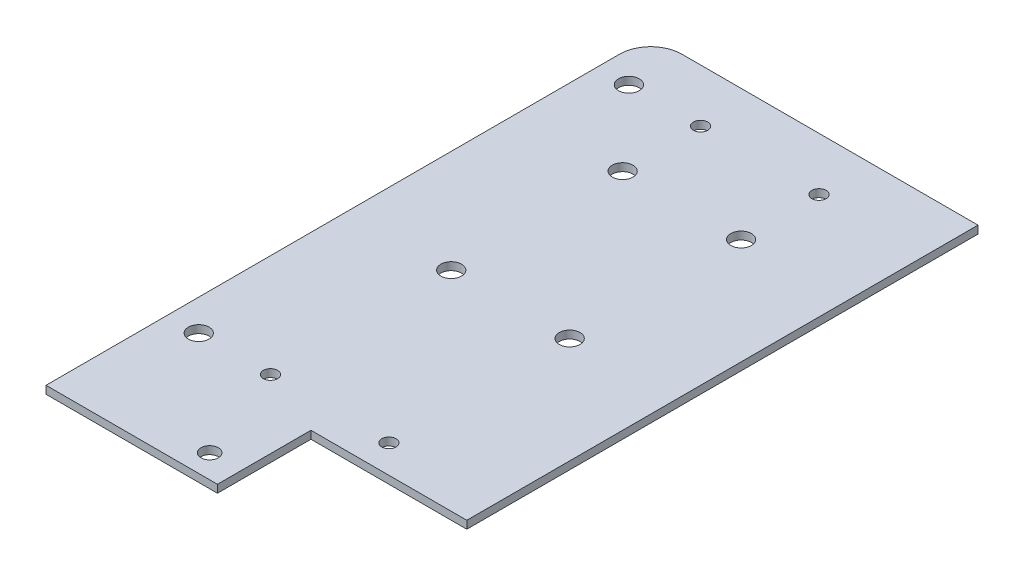
ISO-10303-21;
HEADER;
FILE_DESCRIPTION(('STEP AP214'),'2;1');
FILE_NAME('part.step','',(''),(''),'','','');
FILE_SCHEMA(('AUTOMOTIVE_DESIGN { 1 0 10303 214 1 1 1 1 }'));
ENDSEC;
DATA;
#1=APPLICATION_CONTEXT('core data for automotive mechanical design processes');
#2=APPLICATION_PROTOCOL_DEFINITION('international standard','automotive_design',2000,#1);
#3=PRODUCT_CONTEXT('',#1,'mechanical');
#4=PRODUCT('Part','Part','',(#3));
#5=PRODUCT_RELATED_PRODUCT_CATEGORY('part','',(#4));
#6=PRODUCT_DEFINITION_FORMATION('','',#4);
#7=PRODUCT_DEFINITION_CONTEXT('part definition',#1,'design');
#8=PRODUCT_DEFINITION('design','',#6,#7);
#9=PRODUCT_DEFINITION_SHAPE('','',#8);
#10=(LENGTH_UNIT() NAMED_UNIT(*) SI_UNIT(.MILLI.,.METRE.));
#11=(NAMED_UNIT(*) PLANE_ANGLE_UNIT() SI_UNIT($,.RADIAN.));
#12=(NAMED_UNIT(*) SI_UNIT($,.STERADIAN.) SOLID_ANGLE_UNIT());
#13=UNCERTAINTY_MEASURE_WITH_UNIT(LENGTH_MEASURE(1.E-05),#10,'distance_accuracy_value','');
#14=(GEOMETRIC_REPRESENTATION_CONTEXT(3) GLOBAL_UNCERTAINTY_ASSIGNED_CONTEXT((#13)) GLOBAL_UNIT_ASSIGNED_CONTEXT((#10,
#11,#12)) REPRESENTATION_CONTEXT('',''));
#15=CARTESIAN_POINT('',(0.,0.,0.));
#16=DIRECTION('',(0.,0.,1.));
#17=DIRECTION('',(1.,0.,0.));
#18=AXIS2_PLACEMENT_3D('',#15,#16,#17);
#19=CARTESIAN_POINT('',(0.,1.25,0.));
#20=DIRECTION('',(0.,1.,0.));
#21=DIRECTION('',(0.,0.,1.));
#22=AXIS2_PLACEMENT_3D('',#19,#20,#21);
#23=PLANE('',#22);
#24=CARTESIAN_POINT('',(-9.71346704871064,1.25,3.29011461318052));
#25=DIRECTION('',(0.,1.,0.));
#26=DIRECTION('',(0.,0.,1.));
#27=AXIS2_PLACEMENT_3D('',#24,#25,#26);
#28=CIRCLE('',#27,1.66);
#29=CARTESIAN_POINT('',(-9.71346704871064,1.25,4.95011461318052));
#30=VERTEX_POINT('',#29);
#31=EDGE_CURVE('E217',#30,#30,#28,.T.);
#32=ORIENTED_EDGE('',*,*,#31,.F.);
#33=EDGE_LOOP('',(#32));
#34=FACE_BOUND('',#33,.T.);
#35=CARTESIAN_POINT('',(1.78653295128937,1.25,3.29011461318052));
#36=DIRECTION('',(0.,1.,0.));
#37=DIRECTION('',(0.,0.,1.));
#38=AXIS2_PLACEMENT_3D('',#35,#36,#37);
#39=CIRCLE('',#38,1.15);
#40=CARTESIAN_POINT('',(1.78653295128937,1.25,4.44011461318052));
#41=VERTEX_POINT('',#40);
#42=EDGE_CURVE('E205',#41,#41,#39,.T.);
#43=ORIENTED_EDGE('',*,*,#42,.F.);
#44=EDGE_LOOP('',(#43));
#45=FACE_BOUND('',#44,.T.);
#46=CARTESIAN_POINT('',(20.7865329512894,1.25,-53.2098853868195));
#47=DIRECTION('',(0.,1.,0.));
#48=DIRECTION('',(0.,0.,1.));
#49=AXIS2_PLACEMENT_3D('',#46,#47,#48);
#50=CIRCLE('',#49,1.66);
#51=CARTESIAN_POINT('',(20.7865329512894,1.25,-51.5498853868195));
#52=VERTEX_POINT('',#51);
#53=EDGE_CURVE('E193',#52,#52,#50,.T.);
#54=ORIENTED_EDGE('',*,*,#53,.F.);
#55=EDGE_LOOP('',(#54));
#56=FACE_BOUND('',#55,.T.);
#57=CARTESIAN_POINT('',(1.78653295128937,1.25,-53.2098853868195));
#58=DIRECTION('',(0.,1.,0.));
#59=DIRECTION('',(0.,0.,1.));
#60=AXIS2_PLACEMENT_3D('',#57,#58,#59);
#61=CIRCLE('',#60,1.66);
#62=CARTESIAN_POINT('',(1.78653295128937,1.25,-51.5498853868195));
#63=VERTEX_POINT('',#62);
#64=EDGE_CURVE('E181',#63,#63,#61,.T.);
#65=ORIENTED_EDGE('',*,*,#64,.F.);
#66=EDGE_LOOP('',(#65));
#67=FACE_BOUND('',#66,.T.);
#68=CARTESIAN_POINT('',(1.78653295128937,1.25,-65.7098853868195));
#69=DIRECTION('',(0.,1.,0.));
#70=DIRECTION('',(0.,0.,1.));
#71=AXIS2_PLACEMENT_3D('',#68,#69,#70);
#72=CIRCLE('',#71,1.15);
#73=CARTESIAN_POINT('',(1.78653295128937,1.25,-64.5598853868195));
#74=VERTEX_POINT('',#73);
#75=EDGE_CURVE('E169',#74,#74,#72,.T.);
#76=ORIENTED_EDGE('',*,*,#75,.F.);
#77=EDGE_LOOP('',(#76));
#78=FACE_BOUND('',#77,.T.);
#79=DIRECTION('',(-1.,0.,0.));
#80=VECTOR('',#79,1.);
#81=CARTESIAN_POINT('',(37.7865329512894,1.25,-74.2098853868195));
#82=LINE('',#81,#80);
#83=CARTESIAN_POINT('',(37.7865329512894,1.25,-74.2098853868195));
#84=VERTEX_POINT('',#83);
#85=CARTESIAN_POINT('',(-9.71346704871064,1.25,-74.2098853868195));
#86=VERTEX_POINT('',#85);
#87=EDGE_CURVE('E101',#84,#86,#82,.T.);
#88=ORIENTED_EDGE('',*,*,#87,.T.);
#89=CARTESIAN_POINT('',(-9.71346704871063,1.25,-69.2098853868195));
#90=DIRECTION('',(0.,1.,0.));
#91=DIRECTION('',(0.,0.,1.));
#92=AXIS2_PLACEMENT_3D('',#89,#90,#91);
#93=CIRCLE('',#92,5.);
#94=CARTESIAN_POINT('',(-14.7134670487106,1.25,-69.2098853868195));
#95=VERTEX_POINT('',#94);
#96=EDGE_CURVE('E11',#86,#95,#93,.T.);
#97=ORIENTED_EDGE('',*,*,#96,.T.);
#98=DIRECTION('',(0.,0.,1.));
#99=VECTOR('',#98,1.);
#100=CARTESIAN_POINT('',(-14.7134670487106,1.25,-74.2098853868195));
#101=LINE('',#100,#99);
#102=CARTESIAN_POINT('',(-14.7134670487106,1.25,22.7901146131805));
#103=VERTEX_POINT('',#102);
#104=EDGE_CURVE('E91',#95,#103,#101,.T.);
#105=ORIENTED_EDGE('',*,*,#104,.T.);
#106=DIRECTION('',(1.,0.,0.));
#107=VECTOR('',#106,1.);
#108=CARTESIAN_POINT('',(-14.7134670487106,1.25,22.7901146131805));
#109=LINE('',#108,#107);
#110=CARTESIAN_POINT('',(12.7865329512894,1.25,22.7901146131805));
#111=VERTEX_POINT('',#110);
#112=EDGE_CURVE('E95',#103,#111,#109,.T.);
#113=ORIENTED_EDGE('',*,*,#112,.T.);
#114=DIRECTION('',(0.,0.,-1.));
#115=VECTOR('',#114,1.);
#116=CARTESIAN_POINT('',(12.7865329512894,1.25,22.7901146131805));
#117=LINE('',#116,#115);
#118=CARTESIAN_POINT('',(12.7865329512894,1.25,7.79011461318052));
#119=VERTEX_POINT('',#118);
#120=EDGE_CURVE('E115',#111,#119,#117,.T.);
#121=ORIENTED_EDGE('',*,*,#120,.T.);
#122=DIRECTION('',(1.,0.,0.));
#123=VECTOR('',#122,1.);
#124=CARTESIAN_POINT('',(12.7865329512894,1.25,7.79011461318052));
#125=LINE('',#124,#123);
#126=CARTESIAN_POINT('',(37.7865329512894,1.25,7.79011461318051));
#127=VERTEX_POINT('',#126);
#128=EDGE_CURVE('E117',#119,#127,#125,.T.);
#129=ORIENTED_EDGE('',*,*,#128,.T.);
#130=DIRECTION('',(0.,0.,-1.));
#131=VECTOR('',#130,1.);
#132=CARTESIAN_POINT('',(37.7865329512894,1.25,7.79011461318051));
#133=LINE('',#132,#131);
#134=EDGE_CURVE('E122',#127,#84,#133,.T.);
#135=ORIENTED_EDGE('',*,*,#134,.T.);
#136=EDGE_LOOP('',(#88,#97,#105,#113,#121,#129,#135));
#137=FACE_BOUND('',#136,.T.);
#138=CARTESIAN_POINT('',(-9.71346704871064,1.25,-65.7098853868195));
#139=DIRECTION('',(0.,1.,0.));
#140=DIRECTION('',(0.,0.,1.));
#141=AXIS2_PLACEMENT_3D('',#138,#139,#140);
#142=CIRCLE('',#141,1.66);
#143=CARTESIAN_POINT('',(-9.71346704871064,1.25,-64.0498853868195));
#144=VERTEX_POINT('',#143);
#145=EDGE_CURVE('E127',#144,#144,#142,.T.);
#146=ORIENTED_EDGE('',*,*,#145,.F.);
#147=EDGE_LOOP('',(#146));
#148=FACE_BOUND('',#147,.T.);
#149=CARTESIAN_POINT('',(20.7865329512894,1.25,-65.7098853868195));
#150=DIRECTION('',(0.,1.,0.));
#151=DIRECTION('',(0.,0.,1.));
#152=AXIS2_PLACEMENT_3D('',#149,#150,#151);
#153=CIRCLE('',#152,1.15);
#154=CARTESIAN_POINT('',(20.7865329512894,1.25,-64.5598853868195));
#155=VERTEX_POINT('',#154);
#156=EDGE_CURVE('E175',#155,#155,#153,.T.);
#157=ORIENTED_EDGE('',*,*,#156,.F.);
#158=EDGE_LOOP('',(#157));
#159=FACE_BOUND('',#158,.T.);
#160=CARTESIAN_POINT('',(1.78653295128937,1.25,-25.7098853868195));
#161=DIRECTION('',(0.,1.,0.));
#162=DIRECTION('',(0.,0.,1.));
#163=AXIS2_PLACEMENT_3D('',#160,#161,#162);
#164=CIRCLE('',#163,1.66);
#165=CARTESIAN_POINT('',(1.78653295128937,1.25,-24.0498853868195));
#166=VERTEX_POINT('',#165);
#167=EDGE_CURVE('E187',#166,#166,#164,.T.);
#168=ORIENTED_EDGE('',*,*,#167,.F.);
#169=EDGE_LOOP('',(#168));
#170=FACE_BOUND('',#169,.T.);
#171=CARTESIAN_POINT('',(20.7865329512894,1.25,-25.7098853868195));
#172=DIRECTION('',(0.,1.,0.));
#173=DIRECTION('',(0.,0.,1.));
#174=AXIS2_PLACEMENT_3D('',#171,#172,#173);
#175=CIRCLE('',#174,1.66);
#176=CARTESIAN_POINT('',(20.7865329512894,1.25,-24.0498853868195));
#177=VERTEX_POINT('',#176);
#178=EDGE_CURVE('E199',#177,#177,#175,.T.);
#179=ORIENTED_EDGE('',*,*,#178,.F.);
#180=EDGE_LOOP('',(#179));
#181=FACE_BOUND('',#180,.T.);
#182=CARTESIAN_POINT('',(20.7865329512894,1.25,3.29011461318052));
#183=DIRECTION('',(0.,1.,0.));
#184=DIRECTION('',(0.,0.,1.));
#185=AXIS2_PLACEMENT_3D('',#182,#183,#184);
#186=CIRCLE('',#185,1.15);
#187=CARTESIAN_POINT('',(20.7865329512894,1.25,4.44011461318052));
#188=VERTEX_POINT('',#187);
#189=EDGE_CURVE('E211',#188,#188,#186,.T.);
#190=ORIENTED_EDGE('',*,*,#189,.F.);
#191=EDGE_LOOP('',(#190));
#192=FACE_BOUND('',#191,.T.);
#193=CARTESIAN_POINT('',(7.78653295128937,1.25,19.0401146131805));
#194=DIRECTION('',(0.,1.,0.));
#195=DIRECTION('',(0.,0.,1.));
#196=AXIS2_PLACEMENT_3D('',#193,#194,#195);
#197=CIRCLE('',#196,1.4);
#198=CARTESIAN_POINT('',(7.78653295128937,1.25,20.4401146131805));
#199=VERTEX_POINT('',#198);
#200=EDGE_CURVE('E223',#199,#199,#197,.T.);
#201=ORIENTED_EDGE('',*,*,#200,.F.);
#202=EDGE_LOOP('',(#201));
#203=FACE_BOUND('',#202,.T.);
#204=ADVANCED_FACE('F33',(#34,#45,#56,#67,#78,#137,#148,#159,#170,#181,#192,#203),#23,.T.);
#205=CARTESIAN_POINT('',(0.,0.,0.));
#206=DIRECTION('',(0.,1.,0.));
#207=DIRECTION('',(0.,0.,1.));
#208=AXIS2_PLACEMENT_3D('',#205,#206,#207);
#209=PLANE('',#208);
#210=DIRECTION('',(0.,0.,1.));
#211=VECTOR('',#210,1.);
#212=CARTESIAN_POINT('',(-14.7134670487106,0.,-74.2098853868195));
#213=LINE('',#212,#211);
#214=CARTESIAN_POINT('',(-14.7134670487106,0.,-69.2098853868195));
#215=VERTEX_POINT('',#214);
#216=CARTESIAN_POINT('',(-14.7134670487106,0.,22.7901146131805));
#217=VERTEX_POINT('',#216);
#218=EDGE_CURVE('E106',#215,#217,#213,.T.);
#219=ORIENTED_EDGE('',*,*,#218,.F.);
#220=CARTESIAN_POINT('',(-9.71346704871063,0.,-69.2098853868195));
#221=DIRECTION('',(0.,1.,0.));
#222=DIRECTION('',(0.,0.,1.));
#223=AXIS2_PLACEMENT_3D('',#220,#221,#222);
#224=CIRCLE('',#223,5.);
#225=CARTESIAN_POINT('',(-9.71346704871064,0.,-74.2098853868195));
#226=VERTEX_POINT('',#225);
#227=EDGE_CURVE('E55',#215,#226,#224,.F.);
#228=ORIENTED_EDGE('',*,*,#227,.T.);
#229=DIRECTION('',(-1.,0.,0.));
#230=VECTOR('',#229,1.);
#231=CARTESIAN_POINT('',(37.7865329512894,0.,-74.2098853868195));
#232=LINE('',#231,#230);
#233=CARTESIAN_POINT('',(37.7865329512894,0.,-74.2098853868195));
#234=VERTEX_POINT('',#233);
#235=EDGE_CURVE('E125',#234,#226,#232,.T.);
#236=ORIENTED_EDGE('',*,*,#235,.F.);
#237=DIRECTION('',(0.,0.,-1.));
#238=VECTOR('',#237,1.);
#239=CARTESIAN_POINT('',(37.7865329512894,0.,7.79011461318051));
#240=LINE('',#239,#238);
#241=CARTESIAN_POINT('',(37.7865329512894,0.,7.79011461318051));
#242=VERTEX_POINT('',#241);
#243=EDGE_CURVE('E135',#242,#234,#240,.T.);
#244=ORIENTED_EDGE('',*,*,#243,.F.);
#245=DIRECTION('',(1.,0.,0.));
#246=VECTOR('',#245,1.);
#247=CARTESIAN_POINT('',(12.7865329512894,0.,7.79011461318052));
#248=LINE('',#247,#246);
#249=CARTESIAN_POINT('',(12.7865329512894,0.,7.79011461318052));
#250=VERTEX_POINT('',#249);
#251=EDGE_CURVE('E133',#250,#242,#248,.T.);
#252=ORIENTED_EDGE('',*,*,#251,.F.);
#253=DIRECTION('',(0.,0.,-1.));
#254=VECTOR('',#253,1.);
#255=CARTESIAN_POINT('',(12.7865329512894,0.,22.7901146131805));
#256=LINE('',#255,#254);
#257=CARTESIAN_POINT('',(12.7865329512894,0.,22.7901146131805));
#258=VERTEX_POINT('',#257);
#259=EDGE_CURVE('E131',#258,#250,#256,.T.);
#260=ORIENTED_EDGE('',*,*,#259,.F.);
#261=DIRECTION('',(1.,0.,0.));
#262=VECTOR('',#261,1.);
#263=CARTESIAN_POINT('',(-14.7134670487106,0.,22.7901146131805));
#264=LINE('',#263,#262);
#265=EDGE_CURVE('E129',#217,#258,#264,.T.);
#266=ORIENTED_EDGE('',*,*,#265,.F.);
#267=EDGE_LOOP('',(#219,#228,#236,#244,#252,#260,#266));
#268=FACE_BOUND('',#267,.T.);
#269=CARTESIAN_POINT('',(-9.71346704871064,0.,-65.7098853868195));
#270=DIRECTION('',(0.,1.,0.));
#271=DIRECTION('',(0.,0.,1.));
#272=AXIS2_PLACEMENT_3D('',#269,#270,#271);
#273=CIRCLE('',#272,1.66);
#274=CARTESIAN_POINT('',(-9.71346704871064,0.,-64.0498853868195));
#275=VERTEX_POINT('',#274);
#276=EDGE_CURVE('E166',#275,#275,#273,.T.);
#277=ORIENTED_EDGE('',*,*,#276,.T.);
#278=EDGE_LOOP('',(#277));
#279=FACE_BOUND('',#278,.T.);
#280=CARTESIAN_POINT('',(1.78653295128937,0.,-65.7098853868195));
#281=DIRECTION('',(0.,1.,0.));
#282=DIRECTION('',(0.,0.,1.));
#283=AXIS2_PLACEMENT_3D('',#280,#281,#282);
#284=CIRCLE('',#283,1.15);
#285=CARTESIAN_POINT('',(1.78653295128937,0.,-64.5598853868195));
#286=VERTEX_POINT('',#285);
#287=EDGE_CURVE('E172',#286,#286,#284,.T.);
#288=ORIENTED_EDGE('',*,*,#287,.T.);
#289=EDGE_LOOP('',(#288));
#290=FACE_BOUND('',#289,.T.);
#291=CARTESIAN_POINT('',(20.7865329512894,0.,-65.7098853868195));
#292=DIRECTION('',(0.,1.,0.));
#293=DIRECTION('',(0.,0.,1.));
#294=AXIS2_PLACEMENT_3D('',#291,#292,#293);
#295=CIRCLE('',#294,1.15);
#296=CARTESIAN_POINT('',(20.7865329512894,0.,-64.5598853868195));
#297=VERTEX_POINT('',#296);
#298=EDGE_CURVE('E178',#297,#297,#295,.T.);
#299=ORIENTED_EDGE('',*,*,#298,.T.);
#300=EDGE_LOOP('',(#299));
#301=FACE_BOUND('',#300,.T.);
#302=CARTESIAN_POINT('',(1.78653295128937,0.,-53.2098853868195));
#303=DIRECTION('',(0.,1.,0.));
#304=DIRECTION('',(0.,0.,1.));
#305=AXIS2_PLACEMENT_3D('',#302,#303,#304);
#306=CIRCLE('',#305,1.66);
#307=CARTESIAN_POINT('',(1.78653295128937,0.,-51.5498853868195));
#308=VERTEX_POINT('',#307);
#309=EDGE_CURVE('E184',#308,#308,#306,.T.);
#310=ORIENTED_EDGE('',*,*,#309,.T.);
#311=EDGE_LOOP('',(#310));
#312=FACE_BOUND('',#311,.T.);
#313=CARTESIAN_POINT('',(1.78653295128937,0.,-25.7098853868195));
#314=DIRECTION('',(0.,1.,0.));
#315=DIRECTION('',(0.,0.,1.));
#316=AXIS2_PLACEMENT_3D('',#313,#314,#315);
#317=CIRCLE('',#316,1.66);
#318=CARTESIAN_POINT('',(1.78653295128937,0.,-24.0498853868195));
#319=VERTEX_POINT('',#318);
#320=EDGE_CURVE('E190',#319,#319,#317,.T.);
#321=ORIENTED_EDGE('',*,*,#320,.T.);
#322=EDGE_LOOP('',(#321));
#323=FACE_BOUND('',#322,.T.);
#324=CARTESIAN_POINT('',(20.7865329512894,0.,-53.2098853868195));
#325=DIRECTION('',(0.,1.,0.));
#326=DIRECTION('',(0.,0.,1.));
#327=AXIS2_PLACEMENT_3D('',#324,#325,#326);
#328=CIRCLE('',#327,1.66);
#329=CARTESIAN_POINT('',(20.7865329512894,0.,-51.5498853868195));
#330=VERTEX_POINT('',#329);
#331=EDGE_CURVE('E196',#330,#330,#328,.T.);
#332=ORIENTED_EDGE('',*,*,#331,.T.);
#333=EDGE_LOOP('',(#332));
#334=FACE_BOUND('',#333,.T.);
#335=CARTESIAN_POINT('',(20.7865329512894,0.,-25.7098853868195));
#336=DIRECTION('',(0.,1.,0.));
#337=DIRECTION('',(0.,0.,1.));
#338=AXIS2_PLACEMENT_3D('',#335,#336,#337);
#339=CIRCLE('',#338,1.66);
#340=CARTESIAN_POINT('',(20.7865329512894,0.,-24.0498853868195));
#341=VERTEX_POINT('',#340);
#342=EDGE_CURVE('E202',#341,#341,#339,.T.);
#343=ORIENTED_EDGE('',*,*,#342,.T.);
#344=EDGE_LOOP('',(#343));
#345=FACE_BOUND('',#344,.T.);
#346=CARTESIAN_POINT('',(1.78653295128937,0.,3.29011461318052));
#347=DIRECTION('',(0.,1.,0.));
#348=DIRECTION('',(0.,0.,1.));
#349=AXIS2_PLACEMENT_3D('',#346,#347,#348);
#350=CIRCLE('',#349,1.15);
#351=CARTESIAN_POINT('',(1.78653295128937,0.,4.44011461318052));
#352=VERTEX_POINT('',#351);
#353=EDGE_CURVE('E208',#352,#352,#350,.T.);
#354=ORIENTED_EDGE('',*,*,#353,.T.);
#355=EDGE_LOOP('',(#354));
#356=FACE_BOUND('',#355,.T.);
#357=CARTESIAN_POINT('',(20.7865329512894,0.,3.29011461318052));
#358=DIRECTION('',(0.,1.,0.));
#359=DIRECTION('',(0.,0.,1.));
#360=AXIS2_PLACEMENT_3D('',#357,#358,#359);
#361=CIRCLE('',#360,1.15);
#362=CARTESIAN_POINT('',(20.7865329512894,0.,4.44011461318052));
#363=VERTEX_POINT('',#362);
#364=EDGE_CURVE('E214',#363,#363,#361,.T.);
#365=ORIENTED_EDGE('',*,*,#364,.T.);
#366=EDGE_LOOP('',(#365));
#367=FACE_BOUND('',#366,.T.);
#368=CARTESIAN_POINT('',(-9.71346704871064,0.,3.29011461318052));
#369=DIRECTION('',(0.,1.,0.));
#370=DIRECTION('',(0.,0.,1.));
#371=AXIS2_PLACEMENT_3D('',#368,#369,#370);
#372=CIRCLE('',#371,1.66);
#373=CARTESIAN_POINT('',(-9.71346704871064,0.,4.95011461318052));
#374=VERTEX_POINT('',#373);
#375=EDGE_CURVE('E220',#374,#374,#372,.T.);
#376=ORIENTED_EDGE('',*,*,#375,.T.);
#377=EDGE_LOOP('',(#376));
#378=FACE_BOUND('',#377,.T.);
#379=CARTESIAN_POINT('',(7.78653295128937,0.,19.0401146131805));
#380=DIRECTION('',(0.,1.,0.));
#381=DIRECTION('',(0.,0.,1.));
#382=AXIS2_PLACEMENT_3D('',#379,#380,#381);
#383=CIRCLE('',#382,1.4);
#384=CARTESIAN_POINT('',(7.78653295128937,0.,20.4401146131805));
#385=VERTEX_POINT('',#384);
#386=EDGE_CURVE('E226',#385,#385,#383,.T.);
#387=ORIENTED_EDGE('',*,*,#386,.T.);
#388=EDGE_LOOP('',(#387));
#389=FACE_BOUND('',#388,.T.);
#390=ADVANCED_FACE('F148',(#268,#279,#290,#301,#312,#323,#334,#345,#356,#367,#378,#389),#209,.F.);
#391=CARTESIAN_POINT('',(37.7865329512894,1.25,-74.2098853868195));
#392=DIRECTION('',(0.,0.,1.));
#393=DIRECTION('',(1.,0.,0.));
#394=AXIS2_PLACEMENT_3D('',#391,#392,#393);
#395=PLANE('',#394);
#396=ORIENTED_EDGE('',*,*,#235,.T.);
#397=DIRECTION('',(0.,-1.,0.));
#398=VECTOR('',#397,1.);
#399=CARTESIAN_POINT('',(-9.71346704871064,1.25,-74.2098853868195));
#400=LINE('',#399,#398);
#401=EDGE_CURVE('E41',#226,#86,#400,.F.);
#402=ORIENTED_EDGE('',*,*,#401,.T.);
#403=ORIENTED_EDGE('',*,*,#87,.F.);
#404=DIRECTION('',(0.,-1.,0.));
#405=VECTOR('',#404,1.);
#406=CARTESIAN_POINT('',(37.7865329512894,1.25,-74.2098853868195));
#407=LINE('',#406,#405);
#408=EDGE_CURVE('E124',#84,#234,#407,.T.);
#409=ORIENTED_EDGE('',*,*,#408,.T.);
#410=EDGE_LOOP('',(#396,#402,#403,#409));
#411=FACE_BOUND('',#410,.T.);
#412=ADVANCED_FACE('F164',(#411),#395,.F.);
#413=CARTESIAN_POINT('',(-14.7134670487106,1.25,-74.2098853868195));
#414=DIRECTION('',(1.,0.,0.));
#415=DIRECTION('',(0.,0.,-1.));
#416=AXIS2_PLACEMENT_3D('',#413,#414,#415);
#417=PLANE('',#416);
#418=ORIENTED_EDGE('',*,*,#104,.F.);
#419=DIRECTION('',(0.,-1.,0.));
#420=VECTOR('',#419,1.);
#421=CARTESIAN_POINT('',(-14.7134670487106,1.25,-69.2098853868195));
#422=LINE('',#421,#420);
#423=EDGE_CURVE('E109',#95,#215,#422,.T.);
#424=ORIENTED_EDGE('',*,*,#423,.T.);
#425=ORIENTED_EDGE('',*,*,#218,.T.);
#426=DIRECTION('',(0.,-1.,0.));
#427=VECTOR('',#426,1.);
#428=CARTESIAN_POINT('',(-14.7134670487106,1.25,22.7901146131805));
#429=LINE('',#428,#427);
#430=EDGE_CURVE('E104',#103,#217,#429,.T.);
#431=ORIENTED_EDGE('',*,*,#430,.F.);
#432=EDGE_LOOP('',(#418,#424,#425,#431));
#433=FACE_BOUND('',#432,.T.);
#434=ADVANCED_FACE('F105',(#433),#417,.F.);
#435=CARTESIAN_POINT('',(-14.7134670487106,1.25,22.7901146131805));
#436=DIRECTION('',(0.,0.,-1.));
#437=DIRECTION('',(-1.,0.,0.));
#438=AXIS2_PLACEMENT_3D('',#435,#436,#437);
#439=PLANE('',#438);
#440=ORIENTED_EDGE('',*,*,#265,.T.);
#441=DIRECTION('',(0.,-1.,0.));
#442=VECTOR('',#441,1.);
#443=CARTESIAN_POINT('',(12.7865329512894,1.25,22.7901146131805));
#444=LINE('',#443,#442);
#445=EDGE_CURVE('E110',#111,#258,#444,.T.);
#446=ORIENTED_EDGE('',*,*,#445,.F.);
#447=ORIENTED_EDGE('',*,*,#112,.F.);
#448=ORIENTED_EDGE('',*,*,#430,.T.);
#449=EDGE_LOOP('',(#440,#446,#447,#448));
#450=FACE_BOUND('',#449,.T.);
#451=ADVANCED_FACE('F112',(#450),#439,.F.);
#452=CARTESIAN_POINT('',(12.7865329512894,1.25,22.7901146131805));
#453=DIRECTION('',(-1.,0.,0.));
#454=DIRECTION('',(0.,0.,1.));
#455=AXIS2_PLACEMENT_3D('',#452,#453,#454);
#456=PLANE('',#455);
#457=ORIENTED_EDGE('',*,*,#259,.T.);
#458=DIRECTION('',(0.,-1.,0.));
#459=VECTOR('',#458,1.);
#460=CARTESIAN_POINT('',(12.7865329512894,1.25,7.79011461318052));
#461=LINE('',#460,#459);
#462=EDGE_CURVE('E142',#119,#250,#461,.T.);
#463=ORIENTED_EDGE('',*,*,#462,.F.);
#464=ORIENTED_EDGE('',*,*,#120,.F.);
#465=ORIENTED_EDGE('',*,*,#445,.T.);
#466=EDGE_LOOP('',(#457,#463,#464,#465));
#467=FACE_BOUND('',#466,.T.);
#468=ADVANCED_FACE('F153',(#467),#456,.F.);
#469=CARTESIAN_POINT('',(12.7865329512894,1.25,7.79011461318052));
#470=DIRECTION('',(0.,0.,-1.));
#471=DIRECTION('',(-1.,0.,0.));
#472=AXIS2_PLACEMENT_3D('',#469,#470,#471);
#473=PLANE('',#472);
#474=ORIENTED_EDGE('',*,*,#251,.T.);
#475=DIRECTION('',(0.,-1.,0.));
#476=VECTOR('',#475,1.);
#477=CARTESIAN_POINT('',(37.7865329512894,1.25,7.79011461318051));
#478=LINE('',#477,#476);
#479=EDGE_CURVE('E139',#127,#242,#478,.T.);
#480=ORIENTED_EDGE('',*,*,#479,.F.);
#481=ORIENTED_EDGE('',*,*,#128,.F.);
#482=ORIENTED_EDGE('',*,*,#462,.T.);
#483=EDGE_LOOP('',(#474,#480,#481,#482));
#484=FACE_BOUND('',#483,.T.);
#485=ADVANCED_FACE('F160',(#484),#473,.F.);
#486=CARTESIAN_POINT('',(37.7865329512894,1.25,7.79011461318051));
#487=DIRECTION('',(-1.,0.,0.));
#488=DIRECTION('',(0.,0.,1.));
#489=AXIS2_PLACEMENT_3D('',#486,#487,#488);
#490=PLANE('',#489);
#491=ORIENTED_EDGE('',*,*,#243,.T.);
#492=ORIENTED_EDGE('',*,*,#408,.F.);
#493=ORIENTED_EDGE('',*,*,#134,.F.);
#494=ORIENTED_EDGE('',*,*,#479,.T.);
#495=EDGE_LOOP('',(#491,#492,#493,#494));
#496=FACE_BOUND('',#495,.T.);
#497=ADVANCED_FACE('F163',(#496),#490,.F.);
#498=CARTESIAN_POINT('',(-9.71346704871064,1.25,-65.7098853868195));
#499=DIRECTION('',(0.,-1.,0.));
#500=DIRECTION('',(0.,0.,-1.));
#501=AXIS2_PLACEMENT_3D('',#498,#499,#500);
#502=CYLINDRICAL_SURFACE('',#501,1.66);
#503=ORIENTED_EDGE('',*,*,#145,.T.);
#504=EDGE_LOOP('',(#503));
#505=FACE_BOUND('',#504,.T.);
#506=ORIENTED_EDGE('',*,*,#276,.F.);
#507=EDGE_LOOP('',(#506));
#508=FACE_BOUND('',#507,.T.);
#509=ADVANCED_FACE('F246',(#505,#508),#502,.F.);
#510=CARTESIAN_POINT('',(1.78653295128937,1.25,-65.7098853868195));
#511=DIRECTION('',(0.,-1.,0.));
#512=DIRECTION('',(0.,0.,-1.));
#513=AXIS2_PLACEMENT_3D('',#510,#511,#512);
#514=CYLINDRICAL_SURFACE('',#513,1.15);
#515=ORIENTED_EDGE('',*,*,#75,.T.);
#516=EDGE_LOOP('',(#515));
#517=FACE_BOUND('',#516,.T.);
#518=ORIENTED_EDGE('',*,*,#287,.F.);
#519=EDGE_LOOP('',(#518));
#520=FACE_BOUND('',#519,.T.);
#521=ADVANCED_FACE('F342',(#517,#520),#514,.F.);
#522=CARTESIAN_POINT('',(20.7865329512894,1.25,-65.7098853868195));
#523=DIRECTION('',(0.,-1.,0.));
#524=DIRECTION('',(0.,0.,-1.));
#525=AXIS2_PLACEMENT_3D('',#522,#523,#524);
#526=CYLINDRICAL_SURFACE('',#525,1.15);
#527=ORIENTED_EDGE('',*,*,#156,.T.);
#528=EDGE_LOOP('',(#527));
#529=FACE_BOUND('',#528,.T.);
#530=ORIENTED_EDGE('',*,*,#298,.F.);
#531=EDGE_LOOP('',(#530));
#532=FACE_BOUND('',#531,.T.);
#533=ADVANCED_FACE('F334',(#529,#532),#526,.F.);
#534=CARTESIAN_POINT('',(1.78653295128937,1.25,-53.2098853868195));
#535=DIRECTION('',(0.,-1.,0.));
#536=DIRECTION('',(0.,0.,-1.));
#537=AXIS2_PLACEMENT_3D('',#534,#535,#536);
#538=CYLINDRICAL_SURFACE('',#537,1.66);
#539=ORIENTED_EDGE('',*,*,#64,.T.);
#540=EDGE_LOOP('',(#539));
#541=FACE_BOUND('',#540,.T.);
#542=ORIENTED_EDGE('',*,*,#309,.F.);
#543=EDGE_LOOP('',(#542));
#544=FACE_BOUND('',#543,.T.);
#545=ADVANCED_FACE('F326',(#541,#544),#538,.F.);
#546=CARTESIAN_POINT('',(1.78653295128937,1.25,-25.7098853868195));
#547=DIRECTION('',(0.,-1.,0.));
#548=DIRECTION('',(0.,0.,-1.));
#549=AXIS2_PLACEMENT_3D('',#546,#547,#548);
#550=CYLINDRICAL_SURFACE('',#549,1.66);
#551=ORIENTED_EDGE('',*,*,#167,.T.);
#552=EDGE_LOOP('',(#551));
#553=FACE_BOUND('',#552,.T.);
#554=ORIENTED_EDGE('',*,*,#320,.F.);
#555=EDGE_LOOP('',(#554));
#556=FACE_BOUND('',#555,.T.);
#557=ADVANCED_FACE('F318',(#553,#556),#550,.F.);
#558=CARTESIAN_POINT('',(20.7865329512894,1.25,-53.2098853868195));
#559=DIRECTION('',(0.,-1.,0.));
#560=DIRECTION('',(0.,0.,-1.));
#561=AXIS2_PLACEMENT_3D('',#558,#559,#560);
#562=CYLINDRICAL_SURFACE('',#561,1.66);
#563=ORIENTED_EDGE('',*,*,#53,.T.);
#564=EDGE_LOOP('',(#563));
#565=FACE_BOUND('',#564,.T.);
#566=ORIENTED_EDGE('',*,*,#331,.F.);
#567=EDGE_LOOP('',(#566));
#568=FACE_BOUND('',#567,.T.);
#569=ADVANCED_FACE('F310',(#565,#568),#562,.F.);
#570=CARTESIAN_POINT('',(20.7865329512894,1.25,-25.7098853868195));
#571=DIRECTION('',(0.,-1.,0.));
#572=DIRECTION('',(0.,0.,-1.));
#573=AXIS2_PLACEMENT_3D('',#570,#571,#572);
#574=CYLINDRICAL_SURFACE('',#573,1.66);
#575=ORIENTED_EDGE('',*,*,#178,.T.);
#576=EDGE_LOOP('',(#575));
#577=FACE_BOUND('',#576,.T.);
#578=ORIENTED_EDGE('',*,*,#342,.F.);
#579=EDGE_LOOP('',(#578));
#580=FACE_BOUND('',#579,.T.);
#581=ADVANCED_FACE('F302',(#577,#580),#574,.F.);
#582=CARTESIAN_POINT('',(1.78653295128937,1.25,3.29011461318052));
#583=DIRECTION('',(0.,-1.,0.));
#584=DIRECTION('',(0.,0.,-1.));
#585=AXIS2_PLACEMENT_3D('',#582,#583,#584);
#586=CYLINDRICAL_SURFACE('',#585,1.15);
#587=ORIENTED_EDGE('',*,*,#42,.T.);
#588=EDGE_LOOP('',(#587));
#589=FACE_BOUND('',#588,.T.);
#590=ORIENTED_EDGE('',*,*,#353,.F.);
#591=EDGE_LOOP('',(#590));
#592=FACE_BOUND('',#591,.T.);
#593=ADVANCED_FACE('F294',(#589,#592),#586,.F.);
#594=CARTESIAN_POINT('',(20.7865329512894,1.25,3.29011461318052));
#595=DIRECTION('',(0.,-1.,0.));
#596=DIRECTION('',(0.,0.,-1.));
#597=AXIS2_PLACEMENT_3D('',#594,#595,#596);
#598=CYLINDRICAL_SURFACE('',#597,1.15);
#599=ORIENTED_EDGE('',*,*,#189,.T.);
#600=EDGE_LOOP('',(#599));
#601=FACE_BOUND('',#600,.T.);
#602=ORIENTED_EDGE('',*,*,#364,.F.);
#603=EDGE_LOOP('',(#602));
#604=FACE_BOUND('',#603,.T.);
#605=ADVANCED_FACE('F286',(#601,#604),#598,.F.);
#606=CARTESIAN_POINT('',(-9.71346704871064,1.25,3.29011461318052));
#607=DIRECTION('',(0.,-1.,0.));
#608=DIRECTION('',(0.,0.,-1.));
#609=AXIS2_PLACEMENT_3D('',#606,#607,#608);
#610=CYLINDRICAL_SURFACE('',#609,1.66);
#611=ORIENTED_EDGE('',*,*,#31,.T.);
#612=EDGE_LOOP('',(#611));
#613=FACE_BOUND('',#612,.T.);
#614=ORIENTED_EDGE('',*,*,#375,.F.);
#615=EDGE_LOOP('',(#614));
#616=FACE_BOUND('',#615,.T.);
#617=ADVANCED_FACE('F280',(#613,#616),#610,.F.);
#618=CARTESIAN_POINT('',(7.78653295128937,1.25,19.0401146131805));
#619=DIRECTION('',(0.,-1.,0.));
#620=DIRECTION('',(0.,0.,-1.));
#621=AXIS2_PLACEMENT_3D('',#618,#619,#620);
#622=CYLINDRICAL_SURFACE('',#621,1.4);
#623=ORIENTED_EDGE('',*,*,#200,.T.);
#624=EDGE_LOOP('',(#623));
#625=FACE_BOUND('',#624,.T.);
#626=ORIENTED_EDGE('',*,*,#386,.F.);
#627=EDGE_LOOP('',(#626));
#628=FACE_BOUND('',#627,.T.);
#629=ADVANCED_FACE('F232',(#625,#628),#622,.F.);
#630=CARTESIAN_POINT('',(-9.71346704871063,1.25,-69.2098853868195));
#631=DIRECTION('',(0.,-1.,0.));
#632=DIRECTION('',(0.,0.,-1.));
#633=AXIS2_PLACEMENT_3D('',#630,#631,#632);
#634=CYLINDRICAL_SURFACE('',#633,5.);
#635=ORIENTED_EDGE('',*,*,#96,.F.);
#636=ORIENTED_EDGE('',*,*,#401,.F.);
#637=ORIENTED_EDGE('',*,*,#227,.F.);
#638=ORIENTED_EDGE('',*,*,#423,.F.);
#639=EDGE_LOOP('',(#635,#636,#637,#638));
#640=FACE_BOUND('',#639,.T.);
#641=ADVANCED_FACE('F35',(#640),#634,.T.);
#642=CLOSED_SHELL('',(#204,#390,#412,#434,#451,#468,#485,#497,#509,#521,#533,#545,#557,#569,
#581,#593,#605,#617,#629,#641));
#643=MANIFOLD_SOLID_BREP('B2',#642);
#644=ADVANCED_BREP_SHAPE_REPRESENTATION('',(#18,#643),#14);
#645=SHAPE_DEFINITION_REPRESENTATION(#9,#644);
ENDSEC;
END-ISO-10303-21;
